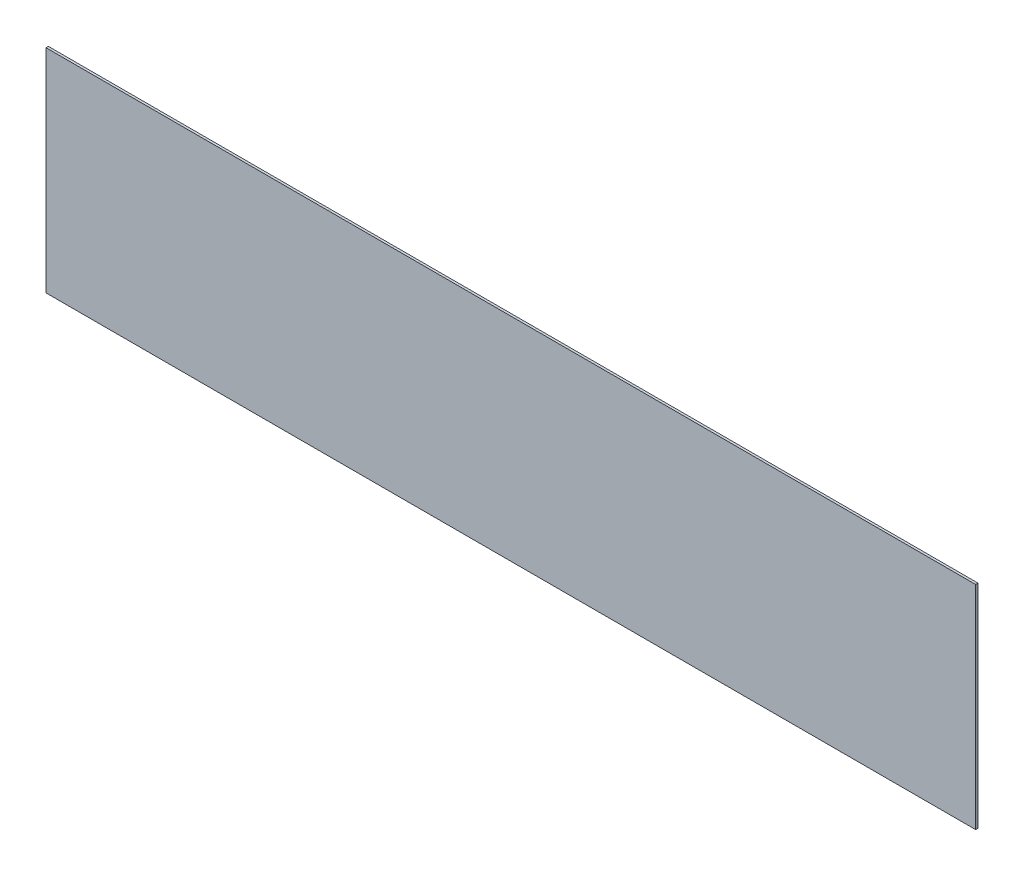
ISO-10303-21;
HEADER;
FILE_DESCRIPTION(('STEP AP214'),'2;1');
FILE_NAME('part.step','',(''),(''),'','','');
FILE_SCHEMA(('AUTOMOTIVE_DESIGN { 1 0 10303 214 1 1 1 1 }'));
ENDSEC;
DATA;
#1=APPLICATION_CONTEXT('core data for automotive mechanical design processes');
#2=APPLICATION_PROTOCOL_DEFINITION('international standard','automotive_design',2000,#1);
#3=PRODUCT_CONTEXT('',#1,'mechanical');
#4=PRODUCT('Part','Part','',(#3));
#5=PRODUCT_RELATED_PRODUCT_CATEGORY('part','',(#4));
#6=PRODUCT_DEFINITION_FORMATION('','',#4);
#7=PRODUCT_DEFINITION_CONTEXT('part definition',#1,'design');
#8=PRODUCT_DEFINITION('design','',#6,#7);
#9=PRODUCT_DEFINITION_SHAPE('','',#8);
#10=(LENGTH_UNIT() NAMED_UNIT(*) SI_UNIT(.MILLI.,.METRE.));
#11=(NAMED_UNIT(*) PLANE_ANGLE_UNIT() SI_UNIT($,.RADIAN.));
#12=(NAMED_UNIT(*) SI_UNIT($,.STERADIAN.) SOLID_ANGLE_UNIT());
#13=UNCERTAINTY_MEASURE_WITH_UNIT(LENGTH_MEASURE(1.E-05),#10,'distance_accuracy_value','');
#14=(GEOMETRIC_REPRESENTATION_CONTEXT(3) GLOBAL_UNCERTAINTY_ASSIGNED_CONTEXT((#13)) GLOBAL_UNIT_ASSIGNED_CONTEXT((#10,
#11,#12)) REPRESENTATION_CONTEXT('',''));
#15=CARTESIAN_POINT('',(0.,0.,0.));
#16=DIRECTION('',(0.,0.,1.));
#17=DIRECTION('',(1.,0.,0.));
#18=AXIS2_PLACEMENT_3D('',#15,#16,#17);
#19=CARTESIAN_POINT('',(-592.709,135.382,0.));
#20=DIRECTION('',(0.,0.,1.));
#21=DIRECTION('',(1.,0.,0.));
#22=AXIS2_PLACEMENT_3D('',#19,#20,#21);
#23=PLANE('',#22);
#24=DIRECTION('',(1.,0.,0.));
#25=VECTOR('',#24,1.);
#26=CARTESIAN_POINT('',(592.709,135.382,0.));
#27=LINE('',#26,#25);
#28=CARTESIAN_POINT('',(-592.709,135.382,0.));
#29=VERTEX_POINT('',#28);
#30=CARTESIAN_POINT('',(592.709,135.382,0.));
#31=VERTEX_POINT('',#30);
#32=EDGE_CURVE('E80',#29,#31,#27,.T.);
#33=ORIENTED_EDGE('',*,*,#32,.T.);
#34=DIRECTION('',(0.,1.,0.));
#35=VECTOR('',#34,1.);
#36=CARTESIAN_POINT('',(592.709,-135.382,0.));
#37=LINE('',#36,#35);
#38=CARTESIAN_POINT('',(592.709,-135.382,0.));
#39=VERTEX_POINT('',#38);
#40=EDGE_CURVE('E67',#31,#39,#37,.F.);
#41=ORIENTED_EDGE('',*,*,#40,.T.);
#42=DIRECTION('',(-1.,0.,0.));
#43=VECTOR('',#42,1.);
#44=CARTESIAN_POINT('',(592.709,-135.382,0.));
#45=LINE('',#44,#43);
#46=CARTESIAN_POINT('',(-592.709,-135.382,0.));
#47=VERTEX_POINT('',#46);
#48=EDGE_CURVE('E54',#39,#47,#45,.T.);
#49=ORIENTED_EDGE('',*,*,#48,.T.);
#50=DIRECTION('',(0.,1.,0.));
#51=VECTOR('',#50,1.);
#52=CARTESIAN_POINT('',(-592.709,-135.382,0.));
#53=LINE('',#52,#51);
#54=EDGE_CURVE('E19',#47,#29,#53,.T.);
#55=ORIENTED_EDGE('',*,*,#54,.T.);
#56=EDGE_LOOP('',(#33,#41,#49,#55));
#57=FACE_BOUND('',#56,.T.);
#58=ADVANCED_FACE('F16',(#57),#23,.F.);
#59=CARTESIAN_POINT('',(-592.709,-135.382,2.9972));
#60=DIRECTION('',(1.,0.,0.));
#61=DIRECTION('',(0.,0.,-1.));
#62=AXIS2_PLACEMENT_3D('',#59,#60,#61);
#63=PLANE('',#62);
#64=DIRECTION('',(0.,0.,1.));
#65=VECTOR('',#64,1.);
#66=CARTESIAN_POINT('',(-592.709,-135.382,2.9972));
#67=LINE('',#66,#65);
#68=CARTESIAN_POINT('',(-592.709,-135.382,2.9972));
#69=VERTEX_POINT('',#68);
#70=EDGE_CURVE('E60',#47,#69,#67,.T.);
#71=ORIENTED_EDGE('',*,*,#70,.T.);
#72=DIRECTION('',(0.,1.,0.));
#73=VECTOR('',#72,1.);
#74=CARTESIAN_POINT('',(-592.709,135.382,2.9972));
#75=LINE('',#74,#73);
#76=CARTESIAN_POINT('',(-592.709,135.382,2.9972));
#77=VERTEX_POINT('',#76);
#78=EDGE_CURVE('E82',#77,#69,#75,.F.);
#79=ORIENTED_EDGE('',*,*,#78,.F.);
#80=DIRECTION('',(0.,0.,1.));
#81=VECTOR('',#80,1.);
#82=CARTESIAN_POINT('',(-592.709,135.382,2.9972));
#83=LINE('',#82,#81);
#84=EDGE_CURVE('E63',#77,#29,#83,.F.);
#85=ORIENTED_EDGE('',*,*,#84,.T.);
#86=ORIENTED_EDGE('',*,*,#54,.F.);
#87=EDGE_LOOP('',(#71,#79,#85,#86));
#88=FACE_BOUND('',#87,.T.);
#89=ADVANCED_FACE('F59',(#88),#63,.F.);
#90=CARTESIAN_POINT('',(592.709,-135.382,2.9972));
#91=DIRECTION('',(0.,1.,0.));
#92=DIRECTION('',(-1.,0.,0.));
#93=AXIS2_PLACEMENT_3D('',#90,#91,#92);
#94=PLANE('',#93);
#95=DIRECTION('',(0.,0.,1.));
#96=VECTOR('',#95,1.);
#97=CARTESIAN_POINT('',(592.709,-135.382,2.9972));
#98=LINE('',#97,#96);
#99=CARTESIAN_POINT('',(592.709,-135.382,2.9972));
#100=VERTEX_POINT('',#99);
#101=EDGE_CURVE('E69',#39,#100,#98,.T.);
#102=ORIENTED_EDGE('',*,*,#101,.T.);
#103=DIRECTION('',(1.,0.,0.));
#104=VECTOR('',#103,1.);
#105=CARTESIAN_POINT('',(-592.709,-135.382,2.9972));
#106=LINE('',#105,#104);
#107=EDGE_CURVE('E73',#69,#100,#106,.T.);
#108=ORIENTED_EDGE('',*,*,#107,.F.);
#109=ORIENTED_EDGE('',*,*,#70,.F.);
#110=ORIENTED_EDGE('',*,*,#48,.F.);
#111=EDGE_LOOP('',(#102,#108,#109,#110));
#112=FACE_BOUND('',#111,.T.);
#113=ADVANCED_FACE('F71',(#112),#94,.F.);
#114=CARTESIAN_POINT('',(592.709,-135.382,2.9972));
#115=DIRECTION('',(-1.,0.,0.));
#116=DIRECTION('',(0.,0.,1.));
#117=AXIS2_PLACEMENT_3D('',#114,#115,#116);
#118=PLANE('',#117);
#119=DIRECTION('',(0.,0.,1.));
#120=VECTOR('',#119,1.);
#121=CARTESIAN_POINT('',(592.709,135.382,2.9972));
#122=LINE('',#121,#120);
#123=CARTESIAN_POINT('',(592.709,135.382,2.9972));
#124=VERTEX_POINT('',#123);
#125=EDGE_CURVE('E34',#31,#124,#122,.T.);
#126=ORIENTED_EDGE('',*,*,#125,.T.);
#127=DIRECTION('',(0.,1.,0.));
#128=VECTOR('',#127,1.);
#129=CARTESIAN_POINT('',(592.709,135.382,2.9972));
#130=LINE('',#129,#128);
#131=EDGE_CURVE('E25',#100,#124,#130,.T.);
#132=ORIENTED_EDGE('',*,*,#131,.F.);
#133=ORIENTED_EDGE('',*,*,#101,.F.);
#134=ORIENTED_EDGE('',*,*,#40,.F.);
#135=EDGE_LOOP('',(#126,#132,#133,#134));
#136=FACE_BOUND('',#135,.T.);
#137=ADVANCED_FACE('F88',(#136),#118,.F.);
#138=CARTESIAN_POINT('',(592.709,135.382,2.9972));
#139=DIRECTION('',(0.,-1.,0.));
#140=DIRECTION('',(1.,0.,0.));
#141=AXIS2_PLACEMENT_3D('',#138,#139,#140);
#142=PLANE('',#141);
#143=ORIENTED_EDGE('',*,*,#84,.F.);
#144=DIRECTION('',(1.,0.,0.));
#145=VECTOR('',#144,1.);
#146=CARTESIAN_POINT('',(-592.709,135.382,2.9972));
#147=LINE('',#146,#145);
#148=EDGE_CURVE('E11',#124,#77,#147,.F.);
#149=ORIENTED_EDGE('',*,*,#148,.F.);
#150=ORIENTED_EDGE('',*,*,#125,.F.);
#151=ORIENTED_EDGE('',*,*,#32,.F.);
#152=EDGE_LOOP('',(#143,#149,#150,#151));
#153=FACE_BOUND('',#152,.T.);
#154=ADVANCED_FACE('F90',(#153),#142,.F.);
#155=CARTESIAN_POINT('',(-592.709,135.382,2.9972));
#156=DIRECTION('',(0.,0.,1.));
#157=DIRECTION('',(1.,0.,0.));
#158=AXIS2_PLACEMENT_3D('',#155,#156,#157);
#159=PLANE('',#158);
#160=ORIENTED_EDGE('',*,*,#131,.T.);
#161=ORIENTED_EDGE('',*,*,#148,.T.);
#162=ORIENTED_EDGE('',*,*,#78,.T.);
#163=ORIENTED_EDGE('',*,*,#107,.T.);
#164=EDGE_LOOP('',(#160,#161,#162,#163));
#165=FACE_BOUND('',#164,.T.);
#166=ADVANCED_FACE('F87',(#165),#159,.T.);
#167=CLOSED_SHELL('',(#58,#89,#113,#137,#154,#166));
#168=MANIFOLD_SOLID_BREP('B1',#167);
#169=ADVANCED_BREP_SHAPE_REPRESENTATION('',(#18,#168),#14);
#170=SHAPE_DEFINITION_REPRESENTATION(#9,#169);
ENDSEC;
END-ISO-10303-21;
